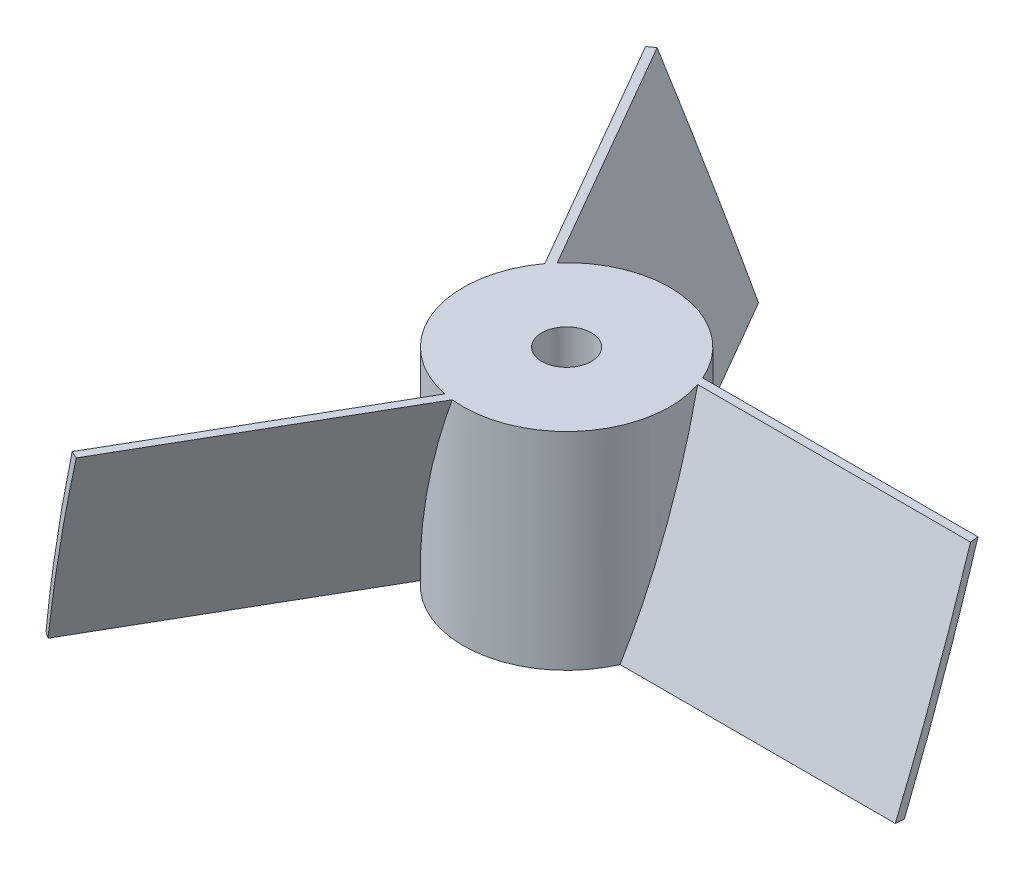
ISO-10303-21;
HEADER;
FILE_DESCRIPTION(('STEP AP214'),'2;1');
FILE_NAME('part.step','',(''),(''),'','','');
FILE_SCHEMA(('AUTOMOTIVE_DESIGN { 1 0 10303 214 1 1 1 1 }'));
ENDSEC;
DATA;
#1=APPLICATION_CONTEXT('core data for automotive mechanical design processes');
#2=APPLICATION_PROTOCOL_DEFINITION('international standard','automotive_design',2000,#1);
#3=PRODUCT_CONTEXT('',#1,'mechanical');
#4=PRODUCT('Part','Part','',(#3));
#5=PRODUCT_RELATED_PRODUCT_CATEGORY('part','',(#4));
#6=PRODUCT_DEFINITION_FORMATION('','',#4);
#7=PRODUCT_DEFINITION_CONTEXT('part definition',#1,'design');
#8=PRODUCT_DEFINITION('design','',#6,#7);
#9=PRODUCT_DEFINITION_SHAPE('','',#8);
#10=(LENGTH_UNIT() NAMED_UNIT(*) SI_UNIT(.MILLI.,.METRE.));
#11=(NAMED_UNIT(*) PLANE_ANGLE_UNIT() SI_UNIT($,.RADIAN.));
#12=(NAMED_UNIT(*) SI_UNIT($,.STERADIAN.) SOLID_ANGLE_UNIT());
#13=UNCERTAINTY_MEASURE_WITH_UNIT(LENGTH_MEASURE(1.E-05),#10,'distance_accuracy_value','');
#14=(GEOMETRIC_REPRESENTATION_CONTEXT(3) GLOBAL_UNCERTAINTY_ASSIGNED_CONTEXT((#13)) GLOBAL_UNIT_ASSIGNED_CONTEXT((#10,
#11,#12)) REPRESENTATION_CONTEXT('',''));
#15=CARTESIAN_POINT('',(0.,0.,0.));
#16=DIRECTION('',(0.,0.,1.));
#17=DIRECTION('',(1.,0.,0.));
#18=AXIS2_PLACEMENT_3D('',#15,#16,#17);
#19=CARTESIAN_POINT('',(0.,50.,0.));
#20=DIRECTION('',(0.,1.,0.));
#21=DIRECTION('',(0.,0.,1.));
#22=AXIS2_PLACEMENT_3D('',#19,#20,#21);
#23=PLANE('',#22);
#24=CARTESIAN_POINT('',(0.,50.,0.));
#25=DIRECTION('',(0.,1.,0.));
#26=DIRECTION('',(0.,0.,1.));
#27=AXIS2_PLACEMENT_3D('',#24,#25,#26);
#28=CIRCLE('',#27,6.);
#29=CARTESIAN_POINT('',(0.,50.,6.));
#30=VERTEX_POINT('',#29);
#31=EDGE_CURVE('E308',#30,#30,#28,.T.);
#32=ORIENTED_EDGE('',*,*,#31,.F.);
#33=EDGE_LOOP('',(#32));
#34=FACE_BOUND('',#33,.T.);
#35=DIRECTION('',(-1.,0.,0.));
#36=VECTOR('',#35,1.);
#37=CARTESIAN_POINT('',(100.,50.,-8.));
#38=LINE('',#37,#36);
#39=CARTESIAN_POINT('',(89.6437393240599,50.,-8.));
#40=VERTEX_POINT('',#39);
#41=CARTESIAN_POINT('',(23.685438564654,50.,-7.99999999999998));
#42=VERTEX_POINT('',#41);
#43=EDGE_CURVE('E143',#40,#42,#38,.T.);
#44=ORIENTED_EDGE('',*,*,#43,.F.);
#45=CARTESIAN_POINT('',(0.,50.,0.));
#46=DIRECTION('',(0.,1.,0.));
#47=DIRECTION('',(0.,0.,1.));
#48=AXIS2_PLACEMENT_3D('',#45,#46,#47);
#49=CIRCLE('',#48,90.);
#50=CARTESIAN_POINT('',(89.4427190999916,50.,-10.));
#51=VERTEX_POINT('',#50);
#52=EDGE_CURVE('E55',#40,#51,#49,.T.);
#53=ORIENTED_EDGE('',*,*,#52,.T.);
#54=DIRECTION('',(-1.,0.,0.));
#55=VECTOR('',#54,1.);
#56=CARTESIAN_POINT('',(100.,50.,-10.));
#57=LINE('',#56,#55);
#58=CARTESIAN_POINT('',(22.9128784747792,50.,-10.));
#59=VERTEX_POINT('',#58);
#60=EDGE_CURVE('E140',#51,#59,#57,.T.);
#61=ORIENTED_EDGE('',*,*,#60,.T.);
#62=CARTESIAN_POINT('',(0.,50.,0.));
#63=DIRECTION('',(0.,1.,0.));
#64=DIRECTION('',(0.,0.,1.));
#65=AXIS2_PLACEMENT_3D('',#62,#63,#64);
#66=CIRCLE('',#65,25.);
#67=CARTESIAN_POINT('',(-18.7709225126026,50.,-16.5121914967659));
#68=VERTEX_POINT('',#67);
#69=EDGE_CURVE('E48',#59,#68,#66,.T.);
#70=ORIENTED_EDGE('',*,*,#69,.T.);
#71=DIRECTION('',(0.500000000000004,0.,0.866025403784436));
#72=VECTOR('',#71,1.);
#73=CARTESIAN_POINT('',(-56.9282032302759,50.,-82.6025403784436));
#74=LINE('',#73,#72);
#75=CARTESIAN_POINT('',(-51.7500728923058,50.,-73.6337555448657));
#76=VERTEX_POINT('',#75);
#77=EDGE_CURVE('E209',#76,#68,#74,.T.);
#78=ORIENTED_EDGE('',*,*,#77,.F.);
#79=CARTESIAN_POINT('',(-53.3816135878405,50.,-72.4596669241481));
#80=VERTEX_POINT('',#79);
#81=EDGE_CURVE('E146',#76,#80,#49,.T.);
#82=ORIENTED_EDGE('',*,*,#81,.T.);
#83=DIRECTION('',(0.500000000000004,0.,0.866025403784436));
#84=VECTOR('',#83,1.);
#85=CARTESIAN_POINT('',(-58.6602540378448,50.,-81.6025403784436));
#86=LINE('',#85,#84);
#87=CARTESIAN_POINT('',(-20.1166932752341,50.,-14.8431348329843));
#88=VERTEX_POINT('',#87);
#89=EDGE_CURVE('E202',#80,#88,#86,.T.);
#90=ORIENTED_EDGE('',*,*,#89,.T.);
#91=CARTESIAN_POINT('',(-4.9145160520513,50.,24.5121914967661));
#92=VERTEX_POINT('',#91);
#93=EDGE_CURVE('E167',#88,#92,#66,.T.);
#94=ORIENTED_EDGE('',*,*,#93,.T.);
#95=DIRECTION('',(0.499999999999992,0.,-0.866025403784443));
#96=VECTOR('',#95,1.);
#97=CARTESIAN_POINT('',(-43.0717967697237,50.,90.6025403784443));
#98=LINE('',#97,#96);
#99=CARTESIAN_POINT('',(-37.8936664317537,50.,81.6337555448663));
#100=VERTEX_POINT('',#99);
#101=EDGE_CURVE('E243',#100,#92,#98,.T.);
#102=ORIENTED_EDGE('',*,*,#101,.F.);
#103=CARTESIAN_POINT('',(-36.0611055121506,50.,82.4596669241487));
#104=VERTEX_POINT('',#103);
#105=EDGE_CURVE('E63',#100,#104,#49,.T.);
#106=ORIENTED_EDGE('',*,*,#105,.T.);
#107=DIRECTION('',(0.499999999999992,0.,-0.866025403784443));
#108=VECTOR('',#107,1.);
#109=CARTESIAN_POINT('',(-41.3397459621548,50.,91.6025403784443));
#110=LINE('',#109,#108);
#111=CARTESIAN_POINT('',(-2.79618519954497,50.,24.8431348329845));
#112=VERTEX_POINT('',#111);
#113=EDGE_CURVE('E196',#104,#112,#110,.T.);
#114=ORIENTED_EDGE('',*,*,#113,.T.);
#115=EDGE_CURVE('E168',#112,#42,#66,.T.);
#116=ORIENTED_EDGE('',*,*,#115,.T.);
#117=EDGE_LOOP('',(#44,#53,#61,#70,#78,#82,#90,#94,#102,#106,#114,#116));
#118=FACE_BOUND('',#117,.T.);
#119=ADVANCED_FACE('F39',(#34,#118),#23,.T.);
#120=CARTESIAN_POINT('',(0.,0.,0.));
#121=DIRECTION('',(0.,1.,0.));
#122=DIRECTION('',(0.,0.,1.));
#123=AXIS2_PLACEMENT_3D('',#120,#121,#122);
#124=PLANE('',#123);
#125=CARTESIAN_POINT('',(0.,0.,0.));
#126=DIRECTION('',(0.,1.,0.));
#127=DIRECTION('',(0.,0.,1.));
#128=AXIS2_PLACEMENT_3D('',#125,#126,#127);
#129=CIRCLE('',#128,6.);
#130=CARTESIAN_POINT('',(0.,0.,6.));
#131=VERTEX_POINT('',#130);
#132=EDGE_CURVE('E306',#131,#131,#129,.T.);
#133=ORIENTED_EDGE('',*,*,#132,.T.);
#134=EDGE_LOOP('',(#133));
#135=FACE_BOUND('',#134,.T.);
#136=CARTESIAN_POINT('',(0.,0.,0.));
#137=DIRECTION('',(0.,1.,0.));
#138=DIRECTION('',(0.,0.,1.));
#139=AXIS2_PLACEMENT_3D('',#136,#137,#138);
#140=CIRCLE('',#139,90.);
#141=CARTESIAN_POINT('',(89.4427190999916,0.,10.));
#142=VERTEX_POINT('',#141);
#143=CARTESIAN_POINT('',(89.6437393240599,0.,8.));
#144=VERTEX_POINT('',#143);
#145=EDGE_CURVE('E129',#142,#144,#140,.T.);
#146=ORIENTED_EDGE('',*,*,#145,.F.);
#147=DIRECTION('',(-1.,0.,0.));
#148=VECTOR('',#147,1.);
#149=CARTESIAN_POINT('',(100.,0.,10.));
#150=LINE('',#149,#148);
#151=CARTESIAN_POINT('',(22.9128784747792,0.,10.));
#152=VERTEX_POINT('',#151);
#153=EDGE_CURVE('E159',#142,#152,#150,.T.);
#154=ORIENTED_EDGE('',*,*,#153,.T.);
#155=CARTESIAN_POINT('',(0.,0.,0.));
#156=DIRECTION('',(0.,1.,0.));
#157=DIRECTION('',(0.,0.,1.));
#158=AXIS2_PLACEMENT_3D('',#155,#156,#157);
#159=CIRCLE('',#158,25.);
#160=CARTESIAN_POINT('',(-18.7709225126024,0.,16.5121914967662));
#161=VERTEX_POINT('',#160);
#162=EDGE_CURVE('E165',#161,#152,#159,.T.);
#163=ORIENTED_EDGE('',*,*,#162,.F.);
#164=DIRECTION('',(0.499999999999992,0.,-0.866025403784443));
#165=VECTOR('',#164,1.);
#166=CARTESIAN_POINT('',(-56.9282032302747,0.,82.6025403784444));
#167=LINE('',#166,#165);
#168=CARTESIAN_POINT('',(-51.7500728923048,0.,73.6337555448664));
#169=VERTEX_POINT('',#168);
#170=EDGE_CURVE('E134',#169,#161,#167,.T.);
#171=ORIENTED_EDGE('',*,*,#170,.F.);
#172=CARTESIAN_POINT('',(-53.3816135878395,0.,72.4596669241488));
#173=VERTEX_POINT('',#172);
#174=EDGE_CURVE('E145',#173,#169,#140,.T.);
#175=ORIENTED_EDGE('',*,*,#174,.F.);
#176=DIRECTION('',(0.499999999999992,0.,-0.866025403784443));
#177=VECTOR('',#176,1.);
#178=CARTESIAN_POINT('',(-58.6602540378436,0.,81.6025403784444));
#179=LINE('',#178,#177);
#180=CARTESIAN_POINT('',(-20.1166932752339,0.,14.8431348329846));
#181=VERTEX_POINT('',#180);
#182=EDGE_CURVE('E240',#173,#181,#179,.T.);
#183=ORIENTED_EDGE('',*,*,#182,.T.);
#184=CARTESIAN_POINT('',(-4.91451605205162,0.,-24.512191496766));
#185=VERTEX_POINT('',#184);
#186=EDGE_CURVE('E172',#185,#181,#159,.T.);
#187=ORIENTED_EDGE('',*,*,#186,.F.);
#188=DIRECTION('',(0.500000000000004,0.,0.866025403784436));
#189=VECTOR('',#188,1.);
#190=CARTESIAN_POINT('',(-43.0717967697249,0.,-90.6025403784437));
#191=LINE('',#190,#189);
#192=CARTESIAN_POINT('',(-37.8936664317548,0.,-81.6337555448658));
#193=VERTEX_POINT('',#192);
#194=EDGE_CURVE('E251',#193,#185,#191,.T.);
#195=ORIENTED_EDGE('',*,*,#194,.F.);
#196=CARTESIAN_POINT('',(-36.0611055121518,0.,-82.4596669241482));
#197=VERTEX_POINT('',#196);
#198=EDGE_CURVE('E225',#197,#193,#140,.T.);
#199=ORIENTED_EDGE('',*,*,#198,.F.);
#200=DIRECTION('',(0.500000000000004,0.,0.866025403784436));
#201=VECTOR('',#200,1.);
#202=CARTESIAN_POINT('',(-41.339745962156,0.,-91.6025403784437));
#203=LINE('',#202,#201);
#204=CARTESIAN_POINT('',(-2.79618519954533,0.,-24.8431348329844));
#205=VERTEX_POINT('',#204);
#206=EDGE_CURVE('E254',#197,#205,#203,.T.);
#207=ORIENTED_EDGE('',*,*,#206,.T.);
#208=CARTESIAN_POINT('',(23.685438564654,0.,8.));
#209=VERTEX_POINT('',#208);
#210=EDGE_CURVE('E169',#209,#205,#159,.T.);
#211=ORIENTED_EDGE('',*,*,#210,.F.);
#212=DIRECTION('',(-1.,0.,0.));
#213=VECTOR('',#212,1.);
#214=CARTESIAN_POINT('',(100.,0.,8.));
#215=LINE('',#214,#213);
#216=EDGE_CURVE('E219',#144,#209,#215,.T.);
#217=ORIENTED_EDGE('',*,*,#216,.F.);
#218=EDGE_LOOP('',(#146,#154,#163,#171,#175,#183,#187,#195,#199,#207,#211,#217));
#219=FACE_BOUND('',#218,.T.);
#220=ADVANCED_FACE('F222',(#135,#219),#124,.F.);
#221=CARTESIAN_POINT('',(100.,0.,8.));
#222=DIRECTION('',(0.,0.338719468272742,0.940887411868727));
#223=DIRECTION('',(0.,-0.940887411868727,0.338719468272742));
#224=AXIS2_PLACEMENT_3D('',#221,#222,#223);
#225=PLANE('',#224);
#226=CARTESIAN_POINT('',(0.,22.2222222222222,0.));
#227=DIRECTION('',(0.,0.338719468272742,0.940887411868727));
#228=DIRECTION('',(0.,0.940887411868727,-0.338719468272742));
#229=AXIS2_PLACEMENT_3D('',#226,#227,#228);
#230=ELLIPSE('',#229,265.706605111728,90.);
#231=EDGE_CURVE('E126',#144,#51,#230,.T.);
#232=ORIENTED_EDGE('',*,*,#231,.F.);
#233=ORIENTED_EDGE('',*,*,#216,.T.);
#234=CARTESIAN_POINT('',(0.,22.2222222222222,0.));
#235=DIRECTION('',(0.,0.338719468272742,0.940887411868727));
#236=DIRECTION('',(0.,-0.940887411868727,0.338719468272742));
#237=AXIS2_PLACEMENT_3D('',#234,#235,#236);
#238=ELLIPSE('',#237,73.8073903088135,25.);
#239=EDGE_CURVE('E151',#209,#59,#238,.T.);
#240=ORIENTED_EDGE('',*,*,#239,.T.);
#241=ORIENTED_EDGE('',*,*,#60,.F.);
#242=EDGE_LOOP('',(#232,#233,#240,#241));
#243=FACE_BOUND('',#242,.T.);
#244=ADVANCED_FACE('F149',(#243),#225,.F.);
#245=CARTESIAN_POINT('',(100.,50.,-8.));
#246=DIRECTION('',(0.,-0.338719468272742,-0.940887411868727));
#247=DIRECTION('',(0.,0.940887411868727,-0.338719468272742));
#248=AXIS2_PLACEMENT_3D('',#245,#246,#247);
#249=PLANE('',#248);
#250=CARTESIAN_POINT('',(0.,27.7777777777778,0.));
#251=DIRECTION('',(0.,-0.338719468272742,-0.940887411868727));
#252=DIRECTION('',(0.,0.940887411868727,-0.338719468272742));
#253=AXIS2_PLACEMENT_3D('',#250,#251,#252);
#254=ELLIPSE('',#253,265.706605111729,90.);
#255=EDGE_CURVE('E135',#40,#142,#254,.T.);
#256=ORIENTED_EDGE('',*,*,#255,.F.);
#257=ORIENTED_EDGE('',*,*,#43,.T.);
#258=CARTESIAN_POINT('',(0.,27.7777777777778,0.));
#259=DIRECTION('',(0.,-0.338719468272742,-0.940887411868727));
#260=DIRECTION('',(0.,-0.940887411868727,0.338719468272742));
#261=AXIS2_PLACEMENT_3D('',#258,#259,#260);
#262=ELLIPSE('',#261,73.8073903088135,25.);
#263=EDGE_CURVE('E153',#42,#152,#262,.T.);
#264=ORIENTED_EDGE('',*,*,#263,.T.);
#265=ORIENTED_EDGE('',*,*,#153,.F.);
#266=EDGE_LOOP('',(#256,#257,#264,#265));
#267=FACE_BOUND('',#266,.T.);
#268=ADVANCED_FACE('F194',(#267),#249,.F.);
#269=CARTESIAN_POINT('',(-56.9282032302747,0.,82.6025403784444));
#270=DIRECTION('',(-0.814832400779314,0.338719468272742,-0.470443705934356));
#271=DIRECTION('',(-0.499999999999992,0.,0.866025403784443));
#272=AXIS2_PLACEMENT_3D('',#269,#270,#271);
#273=PLANE('',#272);
#274=CARTESIAN_POINT('',(0.,22.2222222222222,0.));
#275=DIRECTION('',(-0.814832400779314,0.338719468272742,-0.470443705934356));
#276=DIRECTION('',(0.293339664280553,0.940887411868727,0.169359734136368));
#277=AXIS2_PLACEMENT_3D('',#274,#275,#276);
#278=ELLIPSE('',#277,265.706605111728,90.);
#279=EDGE_CURVE('E235',#169,#104,#278,.T.);
#280=ORIENTED_EDGE('',*,*,#279,.F.);
#281=ORIENTED_EDGE('',*,*,#170,.T.);
#282=CARTESIAN_POINT('',(0.,22.2222222222222,0.));
#283=DIRECTION('',(-0.814832400779314,0.338719468272742,-0.470443705934356));
#284=DIRECTION('',(-0.293339664280553,-0.940887411868727,-0.169359734136368));
#285=AXIS2_PLACEMENT_3D('',#282,#283,#284);
#286=ELLIPSE('',#285,73.8073903088135,25.);
#287=EDGE_CURVE('E189',#161,#112,#286,.T.);
#288=ORIENTED_EDGE('',*,*,#287,.T.);
#289=ORIENTED_EDGE('',*,*,#113,.F.);
#290=EDGE_LOOP('',(#280,#281,#288,#289));
#291=FACE_BOUND('',#290,.T.);
#292=ADVANCED_FACE('F199',(#291),#273,.F.);
#293=CARTESIAN_POINT('',(-43.0717967697237,50.,90.6025403784443));
#294=DIRECTION('',(0.814832400779314,-0.338719468272742,0.470443705934356));
#295=DIRECTION('',(0.499999999999992,0.,-0.866025403784443));
#296=AXIS2_PLACEMENT_3D('',#293,#294,#295);
#297=PLANE('',#296);
#298=CARTESIAN_POINT('',(0.,27.7777777777778,0.));
#299=DIRECTION('',(0.814832400779314,-0.338719468272742,0.470443705934356));
#300=DIRECTION('',(0.293339664280553,0.940887411868727,0.169359734136368));
#301=AXIS2_PLACEMENT_3D('',#298,#299,#300);
#302=ELLIPSE('',#301,265.706605111729,90.);
#303=EDGE_CURVE('E229',#100,#173,#302,.T.);
#304=ORIENTED_EDGE('',*,*,#303,.F.);
#305=ORIENTED_EDGE('',*,*,#101,.T.);
#306=CARTESIAN_POINT('',(0.,27.7777777777778,0.));
#307=DIRECTION('',(0.814832400779314,-0.338719468272742,0.470443705934356));
#308=DIRECTION('',(-0.293339664280553,-0.940887411868727,-0.169359734136368));
#309=AXIS2_PLACEMENT_3D('',#306,#307,#308);
#310=ELLIPSE('',#309,73.8073903088135,25.);
#311=EDGE_CURVE('E201',#92,#181,#310,.T.);
#312=ORIENTED_EDGE('',*,*,#311,.T.);
#313=ORIENTED_EDGE('',*,*,#182,.F.);
#314=EDGE_LOOP('',(#304,#305,#312,#313));
#315=FACE_BOUND('',#314,.T.);
#316=ADVANCED_FACE('F287',(#315),#297,.F.);
#317=CARTESIAN_POINT('',(-43.0717967697249,0.,-90.6025403784437));
#318=DIRECTION('',(0.814832400779307,0.338719468272742,-0.470443705934367));
#319=DIRECTION('',(-0.500000000000004,0.,-0.866025403784436));
#320=AXIS2_PLACEMENT_3D('',#317,#318,#319);
#321=PLANE('',#320);
#322=CARTESIAN_POINT('',(0.,22.2222222222222,0.));
#323=DIRECTION('',(0.814832400779307,0.338719468272742,-0.470443705934367));
#324=DIRECTION('',(-0.293339664280551,0.940887411868727,0.169359734136372));
#325=AXIS2_PLACEMENT_3D('',#322,#323,#324);
#326=ELLIPSE('',#325,265.706605111728,90.);
#327=EDGE_CURVE('E224',#193,#80,#326,.T.);
#328=ORIENTED_EDGE('',*,*,#327,.F.);
#329=ORIENTED_EDGE('',*,*,#194,.T.);
#330=CARTESIAN_POINT('',(0.,22.2222222222222,0.));
#331=DIRECTION('',(0.814832400779307,0.338719468272742,-0.470443705934367));
#332=DIRECTION('',(0.293339664280551,-0.940887411868727,-0.169359734136372));
#333=AXIS2_PLACEMENT_3D('',#330,#331,#332);
#334=ELLIPSE('',#333,73.8073903088135,25.);
#335=EDGE_CURVE('E215',#185,#88,#334,.T.);
#336=ORIENTED_EDGE('',*,*,#335,.T.);
#337=ORIENTED_EDGE('',*,*,#89,.F.);
#338=EDGE_LOOP('',(#328,#329,#336,#337));
#339=FACE_BOUND('',#338,.T.);
#340=ADVANCED_FACE('F284',(#339),#321,.F.);
#341=CARTESIAN_POINT('',(-56.9282032302759,50.,-82.6025403784436));
#342=DIRECTION('',(-0.814832400779307,-0.338719468272742,0.470443705934367));
#343=DIRECTION('',(0.500000000000004,0.,0.866025403784436));
#344=AXIS2_PLACEMENT_3D('',#341,#342,#343);
#345=PLANE('',#344);
#346=CARTESIAN_POINT('',(0.,27.7777777777778,0.));
#347=DIRECTION('',(-0.814832400779307,-0.338719468272742,0.470443705934367));
#348=DIRECTION('',(-0.293339664280551,0.940887411868727,0.169359734136372));
#349=AXIS2_PLACEMENT_3D('',#346,#347,#348);
#350=ELLIPSE('',#349,265.706605111729,90.);
#351=EDGE_CURVE('E11',#76,#197,#350,.T.);
#352=ORIENTED_EDGE('',*,*,#351,.F.);
#353=ORIENTED_EDGE('',*,*,#77,.T.);
#354=CARTESIAN_POINT('',(0.,27.7777777777778,0.));
#355=DIRECTION('',(-0.814832400779307,-0.338719468272742,0.470443705934367));
#356=DIRECTION('',(0.293339664280551,-0.940887411868727,-0.169359734136372));
#357=AXIS2_PLACEMENT_3D('',#354,#355,#356);
#358=ELLIPSE('',#357,73.8073903088135,25.);
#359=EDGE_CURVE('E207',#68,#205,#358,.T.);
#360=ORIENTED_EDGE('',*,*,#359,.T.);
#361=ORIENTED_EDGE('',*,*,#206,.F.);
#362=EDGE_LOOP('',(#352,#353,#360,#361));
#363=FACE_BOUND('',#362,.T.);
#364=ADVANCED_FACE('F260',(#363),#345,.F.);
#365=CARTESIAN_POINT('',(0.,50.,0.));
#366=DIRECTION('',(0.,-1.,0.));
#367=DIRECTION('',(0.,0.,-1.));
#368=AXIS2_PLACEMENT_3D('',#365,#366,#367);
#369=CYLINDRICAL_SURFACE('',#368,25.);
#370=ORIENTED_EDGE('',*,*,#335,.F.);
#371=ORIENTED_EDGE('',*,*,#186,.T.);
#372=ORIENTED_EDGE('',*,*,#311,.F.);
#373=ORIENTED_EDGE('',*,*,#93,.F.);
#374=EDGE_LOOP('',(#370,#371,#372,#373));
#375=FACE_BOUND('',#374,.T.);
#376=ADVANCED_FACE('F41',(#375),#369,.T.);
#377=ORIENTED_EDGE('',*,*,#359,.F.);
#378=ORIENTED_EDGE('',*,*,#69,.F.);
#379=ORIENTED_EDGE('',*,*,#239,.F.);
#380=ORIENTED_EDGE('',*,*,#210,.T.);
#381=EDGE_LOOP('',(#377,#378,#379,#380));
#382=FACE_BOUND('',#381,.T.);
#383=ADVANCED_FACE('F263',(#382),#369,.T.);
#384=ORIENTED_EDGE('',*,*,#287,.F.);
#385=ORIENTED_EDGE('',*,*,#162,.T.);
#386=ORIENTED_EDGE('',*,*,#263,.F.);
#387=ORIENTED_EDGE('',*,*,#115,.F.);
#388=EDGE_LOOP('',(#384,#385,#386,#387));
#389=FACE_BOUND('',#388,.T.);
#390=ADVANCED_FACE('F186',(#389),#369,.T.);
#391=CARTESIAN_POINT('',(0.,0.,0.));
#392=DIRECTION('',(0.,1.,0.));
#393=DIRECTION('',(0.,0.,1.));
#394=AXIS2_PLACEMENT_3D('',#391,#392,#393);
#395=CYLINDRICAL_SURFACE('',#394,90.);
#396=ORIENTED_EDGE('',*,*,#327,.T.);
#397=ORIENTED_EDGE('',*,*,#81,.F.);
#398=ORIENTED_EDGE('',*,*,#351,.T.);
#399=ORIENTED_EDGE('',*,*,#198,.T.);
#400=EDGE_LOOP('',(#396,#397,#398,#399));
#401=FACE_BOUND('',#400,.T.);
#402=ADVANCED_FACE('F269',(#401),#395,.T.);
#403=ORIENTED_EDGE('',*,*,#279,.T.);
#404=ORIENTED_EDGE('',*,*,#105,.F.);
#405=ORIENTED_EDGE('',*,*,#303,.T.);
#406=ORIENTED_EDGE('',*,*,#174,.T.);
#407=EDGE_LOOP('',(#403,#404,#405,#406));
#408=FACE_BOUND('',#407,.T.);
#409=ADVANCED_FACE('F234',(#408),#395,.T.);
#410=ORIENTED_EDGE('',*,*,#231,.T.);
#411=ORIENTED_EDGE('',*,*,#52,.F.);
#412=ORIENTED_EDGE('',*,*,#255,.T.);
#413=ORIENTED_EDGE('',*,*,#145,.T.);
#414=EDGE_LOOP('',(#410,#411,#412,#413));
#415=FACE_BOUND('',#414,.T.);
#416=ADVANCED_FACE('F127',(#415),#395,.T.);
#417=CARTESIAN_POINT('',(0.,0.,0.));
#418=DIRECTION('',(0.,1.,0.));
#419=DIRECTION('',(0.,0.,1.));
#420=AXIS2_PLACEMENT_3D('',#417,#418,#419);
#421=CYLINDRICAL_SURFACE('',#420,6.);
#422=ORIENTED_EDGE('',*,*,#132,.F.);
#423=EDGE_LOOP('',(#422));
#424=FACE_BOUND('',#423,.T.);
#425=ORIENTED_EDGE('',*,*,#31,.T.);
#426=EDGE_LOOP('',(#425));
#427=FACE_BOUND('',#426,.T.);
#428=ADVANCED_FACE('F298',(#424,#427),#421,.F.);
#429=CLOSED_SHELL('',(#119,#220,#244,#268,#292,#316,#340,#364,#376,#383,#390,#402,#409,#416,#428));
#430=MANIFOLD_SOLID_BREP('B2',#429);
#431=ADVANCED_BREP_SHAPE_REPRESENTATION('',(#18,#430),#14);
#432=SHAPE_DEFINITION_REPRESENTATION(#9,#431);
ENDSEC;
END-ISO-10303-21;
